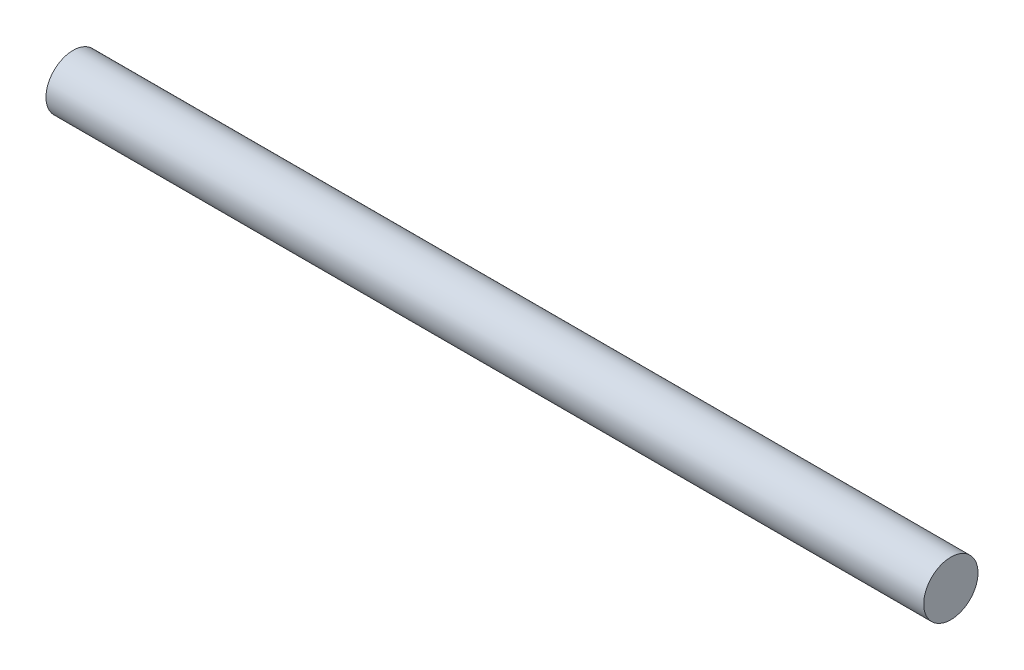
ISO-10303-21;
HEADER;
FILE_DESCRIPTION(('STEP AP214'),'2;1');
FILE_NAME('part.step','',(''),(''),'','','');
FILE_SCHEMA(('AUTOMOTIVE_DESIGN { 1 0 10303 214 1 1 1 1 }'));
ENDSEC;
DATA;
#1=APPLICATION_CONTEXT('core data for automotive mechanical design processes');
#2=APPLICATION_PROTOCOL_DEFINITION('international standard','automotive_design',2000,#1);
#3=PRODUCT_CONTEXT('',#1,'mechanical');
#4=PRODUCT('Part','Part','',(#3));
#5=PRODUCT_RELATED_PRODUCT_CATEGORY('part','',(#4));
#6=PRODUCT_DEFINITION_FORMATION('','',#4);
#7=PRODUCT_DEFINITION_CONTEXT('part definition',#1,'design');
#8=PRODUCT_DEFINITION('design','',#6,#7);
#9=PRODUCT_DEFINITION_SHAPE('','',#8);
#10=(LENGTH_UNIT() NAMED_UNIT(*) SI_UNIT(.MILLI.,.METRE.));
#11=(NAMED_UNIT(*) PLANE_ANGLE_UNIT() SI_UNIT($,.RADIAN.));
#12=(NAMED_UNIT(*) SI_UNIT($,.STERADIAN.) SOLID_ANGLE_UNIT());
#13=UNCERTAINTY_MEASURE_WITH_UNIT(LENGTH_MEASURE(1.E-05),#10,'distance_accuracy_value','');
#14=(GEOMETRIC_REPRESENTATION_CONTEXT(3) GLOBAL_UNCERTAINTY_ASSIGNED_CONTEXT((#13)) GLOBAL_UNIT_ASSIGNED_CONTEXT((#10,
#11,#12)) REPRESENTATION_CONTEXT('',''));
#15=CARTESIAN_POINT('',(0.,0.,0.));
#16=DIRECTION('',(0.,0.,1.));
#17=DIRECTION('',(1.,0.,0.));
#18=AXIS2_PLACEMENT_3D('',#15,#16,#17);
#19=CARTESIAN_POINT('',(24.25,0.,0.));
#20=DIRECTION('',(-1.,0.,0.));
#21=DIRECTION('',(0.,0.,1.));
#22=AXIS2_PLACEMENT_3D('',#19,#20,#21);
#23=CYLINDRICAL_SURFACE('',#22,1.5);
#24=CARTESIAN_POINT('',(24.25,0.,0.));
#25=DIRECTION('',(1.,0.,0.));
#26=DIRECTION('',(0.,0.,-1.));
#27=AXIS2_PLACEMENT_3D('',#24,#25,#26);
#28=CIRCLE('',#27,1.5);
#29=CARTESIAN_POINT('',(24.25,0.,-1.5));
#30=VERTEX_POINT('',#29);
#31=EDGE_CURVE('E10',#30,#30,#28,.T.);
#32=ORIENTED_EDGE('',*,*,#31,.F.);
#33=EDGE_LOOP('',(#32));
#34=FACE_BOUND('',#33,.T.);
#35=CARTESIAN_POINT('',(-24.25,0.,0.));
#36=DIRECTION('',(1.,0.,0.));
#37=DIRECTION('',(0.,0.,-1.));
#38=AXIS2_PLACEMENT_3D('',#35,#36,#37);
#39=CIRCLE('',#38,1.5);
#40=CARTESIAN_POINT('',(-24.25,0.,-1.5));
#41=VERTEX_POINT('',#40);
#42=EDGE_CURVE('E37',#41,#41,#39,.T.);
#43=ORIENTED_EDGE('',*,*,#42,.T.);
#44=EDGE_LOOP('',(#43));
#45=FACE_BOUND('',#44,.T.);
#46=ADVANCED_FACE('F34',(#34,#45),#23,.T.);
#47=CARTESIAN_POINT('',(24.25,0.,0.));
#48=DIRECTION('',(1.,0.,0.));
#49=DIRECTION('',(0.,0.,-1.));
#50=AXIS2_PLACEMENT_3D('',#47,#48,#49);
#51=PLANE('',#50);
#52=ORIENTED_EDGE('',*,*,#31,.T.);
#53=EDGE_LOOP('',(#52));
#54=FACE_BOUND('',#53,.T.);
#55=ADVANCED_FACE('F49',(#54),#51,.T.);
#56=CARTESIAN_POINT('',(-24.25,0.,0.));
#57=DIRECTION('',(1.,0.,0.));
#58=DIRECTION('',(0.,0.,-1.));
#59=AXIS2_PLACEMENT_3D('',#56,#57,#58);
#60=PLANE('',#59);
#61=ORIENTED_EDGE('',*,*,#42,.F.);
#62=EDGE_LOOP('',(#61));
#63=FACE_BOUND('',#62,.T.);
#64=ADVANCED_FACE('F47',(#63),#60,.F.);
#65=CLOSED_SHELL('',(#46,#55,#64));
#66=MANIFOLD_SOLID_BREP('B2',#65);
#67=ADVANCED_BREP_SHAPE_REPRESENTATION('',(#18,#66),#14);
#68=SHAPE_DEFINITION_REPRESENTATION(#9,#67);
ENDSEC;
END-ISO-10303-21;
